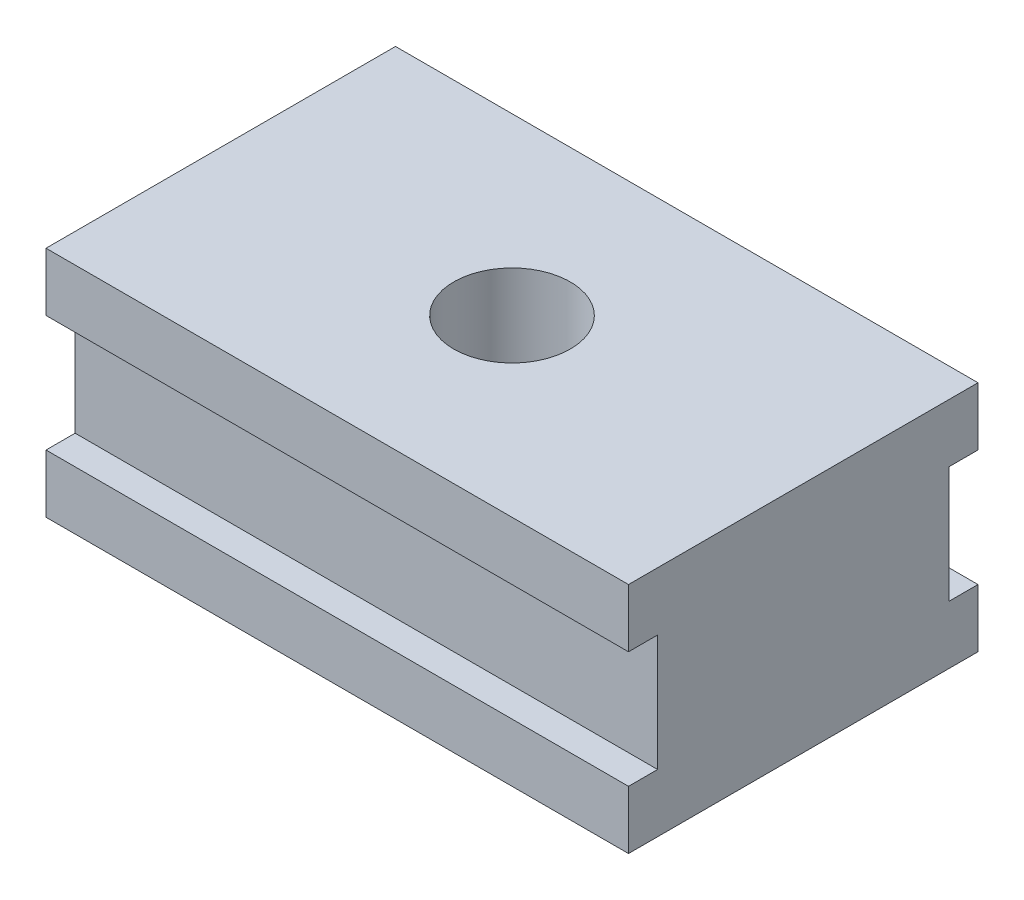
ISO-10303-21;
HEADER;
FILE_DESCRIPTION(('STEP AP214'),'2;1');
FILE_NAME('part.step','',(''),(''),'','','');
FILE_SCHEMA(('AUTOMOTIVE_DESIGN { 1 0 10303 214 1 1 1 1 }'));
ENDSEC;
DATA;
#1=APPLICATION_CONTEXT('core data for automotive mechanical design processes');
#2=APPLICATION_PROTOCOL_DEFINITION('international standard','automotive_design',2000,#1);
#3=PRODUCT_CONTEXT('',#1,'mechanical');
#4=PRODUCT('Part','Part','',(#3));
#5=PRODUCT_RELATED_PRODUCT_CATEGORY('part','',(#4));
#6=PRODUCT_DEFINITION_FORMATION('','',#4);
#7=PRODUCT_DEFINITION_CONTEXT('part definition',#1,'design');
#8=PRODUCT_DEFINITION('design','',#6,#7);
#9=PRODUCT_DEFINITION_SHAPE('','',#8);
#10=(LENGTH_UNIT() NAMED_UNIT(*) SI_UNIT(.MILLI.,.METRE.));
#11=(NAMED_UNIT(*) PLANE_ANGLE_UNIT() SI_UNIT($,.RADIAN.));
#12=(NAMED_UNIT(*) SI_UNIT($,.STERADIAN.) SOLID_ANGLE_UNIT());
#13=UNCERTAINTY_MEASURE_WITH_UNIT(LENGTH_MEASURE(1.E-05),#10,'distance_accuracy_value','');
#14=(GEOMETRIC_REPRESENTATION_CONTEXT(3) GLOBAL_UNCERTAINTY_ASSIGNED_CONTEXT((#13)) GLOBAL_UNIT_ASSIGNED_CONTEXT((#10,
#11,#12)) REPRESENTATION_CONTEXT('',''));
#15=CARTESIAN_POINT('',(0.,0.,0.));
#16=DIRECTION('',(0.,0.,1.));
#17=DIRECTION('',(1.,0.,0.));
#18=AXIS2_PLACEMENT_3D('',#15,#16,#17);
#19=CARTESIAN_POINT('',(10.,-4.,0.));
#20=DIRECTION('',(0.,0.,1.));
#21=DIRECTION('',(1.,0.,0.));
#22=AXIS2_PLACEMENT_3D('',#19,#20,#21);
#23=PLANE('',#22);
#24=DIRECTION('',(0.,-1.,0.));
#25=VECTOR('',#24,1.);
#26=CARTESIAN_POINT('',(-10.,4.,0.));
#27=LINE('',#26,#25);
#28=CARTESIAN_POINT('',(-10.,-2.00000000000039,0.));
#29=VERTEX_POINT('',#28);
#30=CARTESIAN_POINT('',(-10.,-4.,0.));
#31=VERTEX_POINT('',#30);
#32=EDGE_CURVE('E202',#29,#31,#27,.T.);
#33=ORIENTED_EDGE('',*,*,#32,.F.);
#34=DIRECTION('',(1.,0.,0.));
#35=VECTOR('',#34,1.);
#36=CARTESIAN_POINT('',(-10.,-2.00000000000039,0.));
#37=LINE('',#36,#35);
#38=CARTESIAN_POINT('',(10.,-2.00000000000039,0.));
#39=VERTEX_POINT('',#38);
#40=EDGE_CURVE('E154',#29,#39,#37,.T.);
#41=ORIENTED_EDGE('',*,*,#40,.T.);
#42=DIRECTION('',(0.,1.,0.));
#43=VECTOR('',#42,1.);
#44=CARTESIAN_POINT('',(10.,4.,0.));
#45=LINE('',#44,#43);
#46=CARTESIAN_POINT('',(10.,-4.,0.));
#47=VERTEX_POINT('',#46);
#48=EDGE_CURVE('E197',#47,#39,#45,.T.);
#49=ORIENTED_EDGE('',*,*,#48,.F.);
#50=DIRECTION('',(1.,0.,0.));
#51=VECTOR('',#50,1.);
#52=CARTESIAN_POINT('',(-10.,-4.,0.));
#53=LINE('',#52,#51);
#54=EDGE_CURVE('E204',#31,#47,#53,.T.);
#55=ORIENTED_EDGE('',*,*,#54,.F.);
#56=EDGE_LOOP('',(#33,#41,#49,#55));
#57=FACE_BOUND('',#56,.T.);
#58=ADVANCED_FACE('F31',(#57),#23,.F.);
#59=CARTESIAN_POINT('',(10.,-4.,12.));
#60=DIRECTION('',(0.,0.,1.));
#61=DIRECTION('',(1.,0.,0.));
#62=AXIS2_PLACEMENT_3D('',#59,#60,#61);
#63=PLANE('',#62);
#64=DIRECTION('',(1.,0.,0.));
#65=VECTOR('',#64,1.);
#66=CARTESIAN_POINT('',(-10.,2.,12.));
#67=LINE('',#66,#65);
#68=CARTESIAN_POINT('',(-10.,2.,12.));
#69=VERTEX_POINT('',#68);
#70=CARTESIAN_POINT('',(10.,2.,12.));
#71=VERTEX_POINT('',#70);
#72=EDGE_CURVE('E175',#69,#71,#67,.T.);
#73=ORIENTED_EDGE('',*,*,#72,.T.);
#74=DIRECTION('',(0.,1.,0.));
#75=VECTOR('',#74,1.);
#76=CARTESIAN_POINT('',(10.,4.,12.));
#77=LINE('',#76,#75);
#78=CARTESIAN_POINT('',(10.,4.,12.));
#79=VERTEX_POINT('',#78);
#80=EDGE_CURVE('E188',#71,#79,#77,.T.);
#81=ORIENTED_EDGE('',*,*,#80,.T.);
#82=DIRECTION('',(-1.,0.,0.));
#83=VECTOR('',#82,1.);
#84=CARTESIAN_POINT('',(-10.,4.,12.));
#85=LINE('',#84,#83);
#86=CARTESIAN_POINT('',(-10.,4.,12.));
#87=VERTEX_POINT('',#86);
#88=EDGE_CURVE('E187',#79,#87,#85,.T.);
#89=ORIENTED_EDGE('',*,*,#88,.T.);
#90=DIRECTION('',(0.,-1.,0.));
#91=VECTOR('',#90,1.);
#92=CARTESIAN_POINT('',(-10.,4.,12.));
#93=LINE('',#92,#91);
#94=EDGE_CURVE('E191',#87,#69,#93,.T.);
#95=ORIENTED_EDGE('',*,*,#94,.T.);
#96=EDGE_LOOP('',(#73,#81,#89,#95));
#97=FACE_BOUND('',#96,.T.);
#98=ADVANCED_FACE('F246',(#97),#63,.T.);
#99=CARTESIAN_POINT('',(10.,4.,12.));
#100=DIRECTION('',(-1.,0.,0.));
#101=DIRECTION('',(0.,-1.,0.));
#102=AXIS2_PLACEMENT_3D('',#99,#100,#101);
#103=PLANE('',#102);
#104=ORIENTED_EDGE('',*,*,#48,.T.);
#105=DIRECTION('',(0.,0.,-1.));
#106=VECTOR('',#105,1.);
#107=CARTESIAN_POINT('',(10.,-2.00000000000039,0.));
#108=LINE('',#107,#106);
#109=CARTESIAN_POINT('',(10.,-2.00000000000037,1.));
#110=VERTEX_POINT('',#109);
#111=EDGE_CURVE('E142',#110,#39,#108,.T.);
#112=ORIENTED_EDGE('',*,*,#111,.F.);
#113=DIRECTION('',(0.,-1.,0.));
#114=VECTOR('',#113,1.);
#115=CARTESIAN_POINT('',(10.,2.,1.));
#116=LINE('',#115,#114);
#117=CARTESIAN_POINT('',(10.,2.,1.));
#118=VERTEX_POINT('',#117);
#119=EDGE_CURVE('E144',#118,#110,#116,.T.);
#120=ORIENTED_EDGE('',*,*,#119,.F.);
#121=DIRECTION('',(0.,0.,1.));
#122=VECTOR('',#121,1.);
#123=CARTESIAN_POINT('',(10.,2.,0.));
#124=LINE('',#123,#122);
#125=CARTESIAN_POINT('',(10.,2.,0.));
#126=VERTEX_POINT('',#125);
#127=EDGE_CURVE('E122',#126,#118,#124,.T.);
#128=ORIENTED_EDGE('',*,*,#127,.F.);
#129=CARTESIAN_POINT('',(10.,4.,0.));
#130=VERTEX_POINT('',#129);
#131=EDGE_CURVE('E178',#126,#130,#45,.T.);
#132=ORIENTED_EDGE('',*,*,#131,.T.);
#133=DIRECTION('',(0.,0.,-1.));
#134=VECTOR('',#133,1.);
#135=CARTESIAN_POINT('',(10.,4.,12.));
#136=LINE('',#135,#134);
#137=EDGE_CURVE('E11',#79,#130,#136,.T.);
#138=ORIENTED_EDGE('',*,*,#137,.F.);
#139=ORIENTED_EDGE('',*,*,#80,.F.);
#140=DIRECTION('',(0.,0.,1.));
#141=VECTOR('',#140,1.);
#142=CARTESIAN_POINT('',(10.,2.,12.));
#143=LINE('',#142,#141);
#144=CARTESIAN_POINT('',(10.,2.,11.));
#145=VERTEX_POINT('',#144);
#146=EDGE_CURVE('E162',#145,#71,#143,.T.);
#147=ORIENTED_EDGE('',*,*,#146,.F.);
#148=DIRECTION('',(0.,1.,0.));
#149=VECTOR('',#148,1.);
#150=CARTESIAN_POINT('',(10.,2.,11.));
#151=LINE('',#150,#149);
#152=CARTESIAN_POINT('',(10.,-2.00000000000037,11.));
#153=VERTEX_POINT('',#152);
#154=EDGE_CURVE('E171',#153,#145,#151,.T.);
#155=ORIENTED_EDGE('',*,*,#154,.F.);
#156=DIRECTION('',(0.,0.,-1.));
#157=VECTOR('',#156,1.);
#158=CARTESIAN_POINT('',(10.,-2.00000000000037,12.));
#159=LINE('',#158,#157);
#160=CARTESIAN_POINT('',(10.,-2.00000000000037,12.));
#161=VERTEX_POINT('',#160);
#162=EDGE_CURVE('E157',#161,#153,#159,.T.);
#163=ORIENTED_EDGE('',*,*,#162,.F.);
#164=CARTESIAN_POINT('',(10.,-4.,12.));
#165=VERTEX_POINT('',#164);
#166=EDGE_CURVE('E184',#165,#161,#77,.T.);
#167=ORIENTED_EDGE('',*,*,#166,.F.);
#168=DIRECTION('',(0.,0.,-1.));
#169=VECTOR('',#168,1.);
#170=CARTESIAN_POINT('',(10.,-4.,12.));
#171=LINE('',#170,#169);
#172=EDGE_CURVE('E196',#165,#47,#171,.T.);
#173=ORIENTED_EDGE('',*,*,#172,.T.);
#174=EDGE_LOOP('',(#104,#112,#120,#128,#132,#138,#139,#147,#155,#163,#167,#173));
#175=FACE_BOUND('',#174,.T.);
#176=ADVANCED_FACE('F33',(#175),#103,.F.);
#177=CARTESIAN_POINT('',(-10.,4.,12.));
#178=DIRECTION('',(0.,-1.,0.));
#179=DIRECTION('',(0.,0.,-1.));
#180=AXIS2_PLACEMENT_3D('',#177,#178,#179);
#181=PLANE('',#180);
#182=CARTESIAN_POINT('',(0.,4.,6.));
#183=DIRECTION('',(0.,1.,0.));
#184=DIRECTION('',(0.,0.,1.));
#185=AXIS2_PLACEMENT_3D('',#182,#183,#184);
#186=CIRCLE('',#185,2.);
#187=CARTESIAN_POINT('',(0.,4.,8.));
#188=VERTEX_POINT('',#187);
#189=EDGE_CURVE('E147',#188,#188,#186,.T.);
#190=ORIENTED_EDGE('',*,*,#189,.F.);
#191=EDGE_LOOP('',(#190));
#192=FACE_BOUND('',#191,.T.);
#193=DIRECTION('',(-1.,0.,0.));
#194=VECTOR('',#193,1.);
#195=CARTESIAN_POINT('',(-10.,4.,0.));
#196=LINE('',#195,#194);
#197=CARTESIAN_POINT('',(-10.,4.,0.));
#198=VERTEX_POINT('',#197);
#199=EDGE_CURVE('E200',#130,#198,#196,.T.);
#200=ORIENTED_EDGE('',*,*,#199,.T.);
#201=DIRECTION('',(0.,0.,-1.));
#202=VECTOR('',#201,1.);
#203=CARTESIAN_POINT('',(-10.,4.,12.));
#204=LINE('',#203,#202);
#205=EDGE_CURVE('E39',#87,#198,#204,.T.);
#206=ORIENTED_EDGE('',*,*,#205,.F.);
#207=ORIENTED_EDGE('',*,*,#88,.F.);
#208=ORIENTED_EDGE('',*,*,#137,.T.);
#209=EDGE_LOOP('',(#200,#206,#207,#208));
#210=FACE_BOUND('',#209,.T.);
#211=ADVANCED_FACE('F247',(#192,#210),#181,.F.);
#212=CARTESIAN_POINT('',(-10.,4.,12.));
#213=DIRECTION('',(1.,0.,0.));
#214=DIRECTION('',(0.,0.,-1.));
#215=AXIS2_PLACEMENT_3D('',#212,#213,#214);
#216=PLANE('',#215);
#217=DIRECTION('',(0.,-1.,0.));
#218=VECTOR('',#217,1.);
#219=CARTESIAN_POINT('',(-10.,2.,1.));
#220=LINE('',#219,#218);
#221=CARTESIAN_POINT('',(-10.,2.,1.));
#222=VERTEX_POINT('',#221);
#223=CARTESIAN_POINT('',(-10.,-2.00000000000036,1.));
#224=VERTEX_POINT('',#223);
#225=EDGE_CURVE('E130',#222,#224,#220,.T.);
#226=ORIENTED_EDGE('',*,*,#225,.T.);
#227=DIRECTION('',(0.,0.,-1.));
#228=VECTOR('',#227,1.);
#229=CARTESIAN_POINT('',(-10.,-2.00000000000039,0.));
#230=LINE('',#229,#228);
#231=EDGE_CURVE('E135',#224,#29,#230,.T.);
#232=ORIENTED_EDGE('',*,*,#231,.T.);
#233=ORIENTED_EDGE('',*,*,#32,.T.);
#234=DIRECTION('',(0.,0.,-1.));
#235=VECTOR('',#234,1.);
#236=CARTESIAN_POINT('',(-10.,-4.,12.));
#237=LINE('',#236,#235);
#238=CARTESIAN_POINT('',(-10.,-4.,12.));
#239=VERTEX_POINT('',#238);
#240=EDGE_CURVE('E208',#239,#31,#237,.T.);
#241=ORIENTED_EDGE('',*,*,#240,.F.);
#242=CARTESIAN_POINT('',(-10.,-2.00000000000036,12.));
#243=VERTEX_POINT('',#242);
#244=EDGE_CURVE('E190',#243,#239,#93,.T.);
#245=ORIENTED_EDGE('',*,*,#244,.F.);
#246=DIRECTION('',(0.,0.,-1.));
#247=VECTOR('',#246,1.);
#248=CARTESIAN_POINT('',(-10.,-2.00000000000036,12.));
#249=LINE('',#248,#247);
#250=CARTESIAN_POINT('',(-10.,-2.00000000000036,11.));
#251=VERTEX_POINT('',#250);
#252=EDGE_CURVE('E54',#243,#251,#249,.T.);
#253=ORIENTED_EDGE('',*,*,#252,.T.);
#254=DIRECTION('',(0.,1.,0.));
#255=VECTOR('',#254,1.);
#256=CARTESIAN_POINT('',(-10.,2.,11.));
#257=LINE('',#256,#255);
#258=CARTESIAN_POINT('',(-10.,2.,11.));
#259=VERTEX_POINT('',#258);
#260=EDGE_CURVE('E161',#251,#259,#257,.T.);
#261=ORIENTED_EDGE('',*,*,#260,.T.);
#262=DIRECTION('',(0.,0.,1.));
#263=VECTOR('',#262,1.);
#264=CARTESIAN_POINT('',(-10.,2.,12.));
#265=LINE('',#264,#263);
#266=EDGE_CURVE('E165',#259,#69,#265,.T.);
#267=ORIENTED_EDGE('',*,*,#266,.T.);
#268=ORIENTED_EDGE('',*,*,#94,.F.);
#269=ORIENTED_EDGE('',*,*,#205,.T.);
#270=CARTESIAN_POINT('',(-10.,2.00000000000001,0.));
#271=VERTEX_POINT('',#270);
#272=EDGE_CURVE('E141',#198,#271,#27,.T.);
#273=ORIENTED_EDGE('',*,*,#272,.T.);
#274=DIRECTION('',(0.,0.,1.));
#275=VECTOR('',#274,1.);
#276=CARTESIAN_POINT('',(-10.,2.00000000000001,0.));
#277=LINE('',#276,#275);
#278=EDGE_CURVE('E46',#271,#222,#277,.T.);
#279=ORIENTED_EDGE('',*,*,#278,.T.);
#280=EDGE_LOOP('',(#226,#232,#233,#241,#245,#253,#261,#267,#268,#269,#273,#279));
#281=FACE_BOUND('',#280,.T.);
#282=ADVANCED_FACE('F138',(#281),#216,.F.);
#283=CARTESIAN_POINT('',(-10.,-4.,12.));
#284=DIRECTION('',(0.,1.,0.));
#285=DIRECTION('',(0.,0.,1.));
#286=AXIS2_PLACEMENT_3D('',#283,#284,#285);
#287=PLANE('',#286);
#288=CARTESIAN_POINT('',(0.,-4.,6.));
#289=DIRECTION('',(0.,1.,0.));
#290=DIRECTION('',(0.,0.,1.));
#291=AXIS2_PLACEMENT_3D('',#288,#289,#290);
#292=CIRCLE('',#291,2.);
#293=CARTESIAN_POINT('',(0.,-4.,8.));
#294=VERTEX_POINT('',#293);
#295=EDGE_CURVE('E152',#294,#294,#292,.T.);
#296=ORIENTED_EDGE('',*,*,#295,.T.);
#297=EDGE_LOOP('',(#296));
#298=FACE_BOUND('',#297,.T.);
#299=ORIENTED_EDGE('',*,*,#54,.T.);
#300=ORIENTED_EDGE('',*,*,#172,.F.);
#301=DIRECTION('',(1.,0.,0.));
#302=VECTOR('',#301,1.);
#303=CARTESIAN_POINT('',(-10.,-4.,12.));
#304=LINE('',#303,#302);
#305=EDGE_CURVE('E194',#239,#165,#304,.T.);
#306=ORIENTED_EDGE('',*,*,#305,.F.);
#307=ORIENTED_EDGE('',*,*,#240,.T.);
#308=EDGE_LOOP('',(#299,#300,#306,#307));
#309=FACE_BOUND('',#308,.T.);
#310=ADVANCED_FACE('F231',(#298,#309),#287,.F.);
#311=DIRECTION('',(1.,0.,0.));
#312=VECTOR('',#311,1.);
#313=CARTESIAN_POINT('',(-10.,-2.00000000000036,12.));
#314=LINE('',#313,#312);
#315=EDGE_CURVE('E168',#243,#161,#314,.T.);
#316=ORIENTED_EDGE('',*,*,#315,.F.);
#317=ORIENTED_EDGE('',*,*,#244,.T.);
#318=ORIENTED_EDGE('',*,*,#305,.T.);
#319=ORIENTED_EDGE('',*,*,#166,.T.);
#320=EDGE_LOOP('',(#316,#317,#318,#319));
#321=FACE_BOUND('',#320,.T.);
#322=ADVANCED_FACE('F235',(#321),#63,.T.);
#323=ORIENTED_EDGE('',*,*,#131,.F.);
#324=DIRECTION('',(1.,0.,0.));
#325=VECTOR('',#324,1.);
#326=CARTESIAN_POINT('',(-10.,2.00000000000001,0.));
#327=LINE('',#326,#325);
#328=EDGE_CURVE('E127',#271,#126,#327,.T.);
#329=ORIENTED_EDGE('',*,*,#328,.F.);
#330=ORIENTED_EDGE('',*,*,#272,.F.);
#331=ORIENTED_EDGE('',*,*,#199,.F.);
#332=EDGE_LOOP('',(#323,#329,#330,#331));
#333=FACE_BOUND('',#332,.T.);
#334=ADVANCED_FACE('F217',(#333),#23,.F.);
#335=CARTESIAN_POINT('',(-10.,2.,12.));
#336=DIRECTION('',(0.,1.,0.));
#337=DIRECTION('',(-1.,0.,0.));
#338=AXIS2_PLACEMENT_3D('',#335,#336,#337);
#339=PLANE('',#338);
#340=ORIENTED_EDGE('',*,*,#146,.T.);
#341=ORIENTED_EDGE('',*,*,#72,.F.);
#342=ORIENTED_EDGE('',*,*,#266,.F.);
#343=DIRECTION('',(1.,0.,0.));
#344=VECTOR('',#343,1.);
#345=CARTESIAN_POINT('',(-10.,2.,11.));
#346=LINE('',#345,#344);
#347=EDGE_CURVE('E179',#259,#145,#346,.T.);
#348=ORIENTED_EDGE('',*,*,#347,.T.);
#349=EDGE_LOOP('',(#340,#341,#342,#348));
#350=FACE_BOUND('',#349,.T.);
#351=ADVANCED_FACE('F243',(#350),#339,.F.);
#352=CARTESIAN_POINT('',(-10.,2.,11.));
#353=DIRECTION('',(0.,0.,-1.));
#354=DIRECTION('',(-1.,0.,0.));
#355=AXIS2_PLACEMENT_3D('',#352,#353,#354);
#356=PLANE('',#355);
#357=ORIENTED_EDGE('',*,*,#154,.T.);
#358=ORIENTED_EDGE('',*,*,#347,.F.);
#359=ORIENTED_EDGE('',*,*,#260,.F.);
#360=DIRECTION('',(1.,0.,0.));
#361=VECTOR('',#360,1.);
#362=CARTESIAN_POINT('',(-10.,-2.00000000000036,11.));
#363=LINE('',#362,#361);
#364=EDGE_CURVE('E181',#251,#153,#363,.T.);
#365=ORIENTED_EDGE('',*,*,#364,.T.);
#366=EDGE_LOOP('',(#357,#358,#359,#365));
#367=FACE_BOUND('',#366,.T.);
#368=ADVANCED_FACE('F239',(#367),#356,.F.);
#369=CARTESIAN_POINT('',(-10.,-2.00000000000036,12.));
#370=DIRECTION('',(0.,-1.,0.));
#371=DIRECTION('',(1.,0.,0.));
#372=AXIS2_PLACEMENT_3D('',#369,#370,#371);
#373=PLANE('',#372);
#374=ORIENTED_EDGE('',*,*,#162,.T.);
#375=ORIENTED_EDGE('',*,*,#364,.F.);
#376=ORIENTED_EDGE('',*,*,#252,.F.);
#377=ORIENTED_EDGE('',*,*,#315,.T.);
#378=EDGE_LOOP('',(#374,#375,#376,#377));
#379=FACE_BOUND('',#378,.T.);
#380=ADVANCED_FACE('F274',(#379),#373,.F.);
#381=CARTESIAN_POINT('',(-10.,-2.00000000000039,0.));
#382=DIRECTION('',(0.,-1.,0.));
#383=DIRECTION('',(0.,0.,-1.));
#384=AXIS2_PLACEMENT_3D('',#381,#382,#383);
#385=PLANE('',#384);
#386=ORIENTED_EDGE('',*,*,#111,.T.);
#387=ORIENTED_EDGE('',*,*,#40,.F.);
#388=ORIENTED_EDGE('',*,*,#231,.F.);
#389=DIRECTION('',(1.,0.,0.));
#390=VECTOR('',#389,1.);
#391=CARTESIAN_POINT('',(-10.,-2.00000000000036,1.));
#392=LINE('',#391,#390);
#393=EDGE_CURVE('E126',#224,#110,#392,.T.);
#394=ORIENTED_EDGE('',*,*,#393,.T.);
#395=EDGE_LOOP('',(#386,#387,#388,#394));
#396=FACE_BOUND('',#395,.T.);
#397=ADVANCED_FACE('F223',(#396),#385,.F.);
#398=CARTESIAN_POINT('',(-10.,2.,1.));
#399=DIRECTION('',(0.,0.,1.));
#400=DIRECTION('',(0.,-1.,0.));
#401=AXIS2_PLACEMENT_3D('',#398,#399,#400);
#402=PLANE('',#401);
#403=ORIENTED_EDGE('',*,*,#119,.T.);
#404=ORIENTED_EDGE('',*,*,#393,.F.);
#405=ORIENTED_EDGE('',*,*,#225,.F.);
#406=DIRECTION('',(1.,0.,0.));
#407=VECTOR('',#406,1.);
#408=CARTESIAN_POINT('',(-10.,2.,1.));
#409=LINE('',#408,#407);
#410=EDGE_CURVE('E118',#222,#118,#409,.T.);
#411=ORIENTED_EDGE('',*,*,#410,.T.);
#412=EDGE_LOOP('',(#403,#404,#405,#411));
#413=FACE_BOUND('',#412,.T.);
#414=ADVANCED_FACE('F131',(#413),#402,.F.);
#415=CARTESIAN_POINT('',(-10.,2.00000000000001,0.));
#416=DIRECTION('',(0.,1.,0.));
#417=DIRECTION('',(0.,0.,1.));
#418=AXIS2_PLACEMENT_3D('',#415,#416,#417);
#419=PLANE('',#418);
#420=ORIENTED_EDGE('',*,*,#127,.T.);
#421=ORIENTED_EDGE('',*,*,#410,.F.);
#422=ORIENTED_EDGE('',*,*,#278,.F.);
#423=ORIENTED_EDGE('',*,*,#328,.T.);
#424=EDGE_LOOP('',(#420,#421,#422,#423));
#425=FACE_BOUND('',#424,.T.);
#426=ADVANCED_FACE('F120',(#425),#419,.F.);
#427=CARTESIAN_POINT('',(0.,-4.,6.));
#428=DIRECTION('',(0.,1.,0.));
#429=DIRECTION('',(0.,0.,1.));
#430=AXIS2_PLACEMENT_3D('',#427,#428,#429);
#431=CYLINDRICAL_SURFACE('',#430,2.);
#432=ORIENTED_EDGE('',*,*,#295,.F.);
#433=EDGE_LOOP('',(#432));
#434=FACE_BOUND('',#433,.T.);
#435=ORIENTED_EDGE('',*,*,#189,.T.);
#436=EDGE_LOOP('',(#435));
#437=FACE_BOUND('',#436,.T.);
#438=ADVANCED_FACE('F281',(#434,#437),#431,.F.);
#439=CLOSED_SHELL('',(#58,#98,#176,#211,#282,#310,#322,#334,#351,#368,#380,#397,#414,#426,#438));
#440=MANIFOLD_SOLID_BREP('B2',#439);
#441=ADVANCED_BREP_SHAPE_REPRESENTATION('',(#18,#440),#14);
#442=SHAPE_DEFINITION_REPRESENTATION(#9,#441);
ENDSEC;
END-ISO-10303-21;
